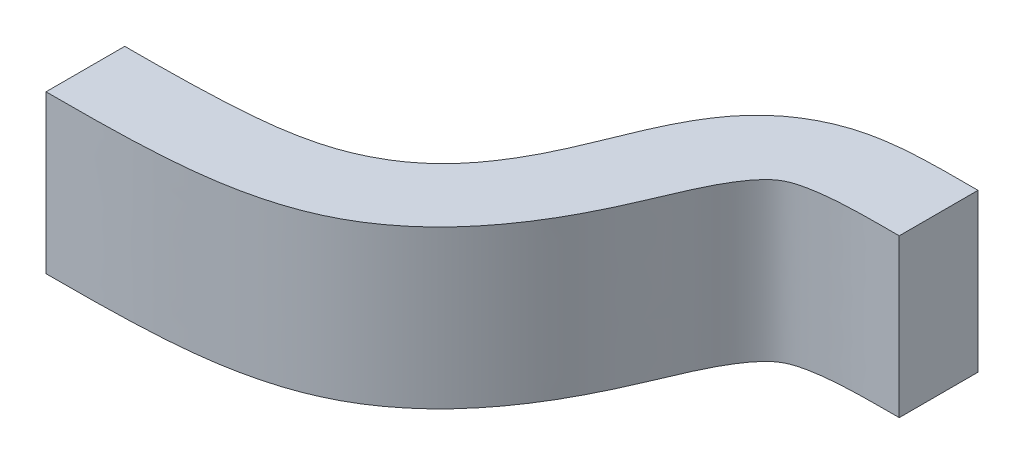
ISO-10303-21;
HEADER;
FILE_DESCRIPTION(('STEP AP214'),'2;1');
FILE_NAME('part.step','',(''),(''),'','','');
FILE_SCHEMA(('AUTOMOTIVE_DESIGN { 1 0 10303 214 1 1 1 1 }'));
ENDSEC;
DATA;
#1=APPLICATION_CONTEXT('core data for automotive mechanical design processes');
#2=APPLICATION_PROTOCOL_DEFINITION('international standard','automotive_design',2000,#1);
#3=PRODUCT_CONTEXT('',#1,'mechanical');
#4=PRODUCT('Part','Part','',(#3));
#5=PRODUCT_RELATED_PRODUCT_CATEGORY('part','',(#4));
#6=PRODUCT_DEFINITION_FORMATION('','',#4);
#7=PRODUCT_DEFINITION_CONTEXT('part definition',#1,'design');
#8=PRODUCT_DEFINITION('design','',#6,#7);
#9=PRODUCT_DEFINITION_SHAPE('','',#8);
#10=(LENGTH_UNIT() NAMED_UNIT(*) SI_UNIT(.MILLI.,.METRE.));
#11=(NAMED_UNIT(*) PLANE_ANGLE_UNIT() SI_UNIT($,.RADIAN.));
#12=(NAMED_UNIT(*) SI_UNIT($,.STERADIAN.) SOLID_ANGLE_UNIT());
#13=UNCERTAINTY_MEASURE_WITH_UNIT(LENGTH_MEASURE(1.E-05),#10,'distance_accuracy_value','');
#14=(GEOMETRIC_REPRESENTATION_CONTEXT(3) GLOBAL_UNCERTAINTY_ASSIGNED_CONTEXT((#13)) GLOBAL_UNIT_ASSIGNED_CONTEXT((#10,
#11,#12)) REPRESENTATION_CONTEXT('',''));
#15=CARTESIAN_POINT('',(0.,0.,0.));
#16=DIRECTION('',(0.,0.,1.));
#17=DIRECTION('',(1.,0.,0.));
#18=AXIS2_PLACEMENT_3D('',#15,#16,#17);
#19=CARTESIAN_POINT('',(0.,0.15,0.075));
#20=CARTESIAN_POINT('',(0.0905777344704142,0.15,0.075));
#21=CARTESIAN_POINT('',(0.285559759716426,0.15,0.0742434436378116));
#22=CARTESIAN_POINT('',(0.563518229604912,0.15,0.000968806615744211));
#23=CARTESIAN_POINT('',(0.710460925250525,0.15,-0.211613939113469));
#24=CARTESIAN_POINT('',(0.77988045420617,0.15,-0.395414769660227));
#25=CARTESIAN_POINT('',(0.827653517794069,0.15,-0.471375806830608));
#26=CARTESIAN_POINT('',(0.864080224049518,0.15,-0.490115927902738));
#27=CARTESIAN_POINT('',(0.945491982314277,0.15,-0.500044642488538));
#28=CARTESIAN_POINT('',(1.01779453444384,0.15,-0.5));
#29=CARTESIAN_POINT('',(1.05,0.15,-0.5));
#30=B_SPLINE_CURVE_WITH_KNOTS('',3,(#19,#20,#21,#22,#23,#24,#25,#26,#27,#28,#29),.UNSPECIFIED.,
.F.,.F.,(4,1,1,1,1,1,1,1,4),(0.,0.125,0.25,0.5,0.625,0.75,0.875,0.9375,1.),.UNSPECIFIED.);
#31=DIRECTION('',(0.,-1.,0.));
#32=VECTOR('',#31,1.);
#33=SURFACE_OF_LINEAR_EXTRUSION('',#30,#32);
#34=CARTESIAN_POINT('',(0.,-0.15,0.075));
#35=CARTESIAN_POINT('',(0.0905777344704142,-0.15,0.075));
#36=CARTESIAN_POINT('',(0.285559759716426,-0.15,0.0742434436378116));
#37=CARTESIAN_POINT('',(0.563518229604912,-0.15,0.000968806615744211));
#38=CARTESIAN_POINT('',(0.710460925250525,-0.15,-0.211613939113469));
#39=CARTESIAN_POINT('',(0.77988045420617,-0.15,-0.395414769660227));
#40=CARTESIAN_POINT('',(0.827653517794069,-0.15,-0.471375806830608));
#41=CARTESIAN_POINT('',(0.864080224049518,-0.15,-0.490115927902738));
#42=CARTESIAN_POINT('',(0.945491982314277,-0.15,-0.500044642488538));
#43=CARTESIAN_POINT('',(1.01779453444384,-0.15,-0.5));
#44=CARTESIAN_POINT('',(1.05,-0.15,-0.5));
#45=B_SPLINE_CURVE_WITH_KNOTS('',3,(#34,#35,#36,#37,#38,#39,#40,#41,#42,#43,#44),.UNSPECIFIED.,
.F.,.F.,(4,1,1,1,1,1,1,1,4),(0.,0.125,0.25,0.5,0.625,0.75,0.875,0.9375,1.),.UNSPECIFIED.);
#46=CARTESIAN_POINT('',(0.,-0.15,0.075));
#47=VERTEX_POINT('',#46);
#48=CARTESIAN_POINT('',(1.05,-0.15,-0.5));
#49=VERTEX_POINT('',#48);
#50=EDGE_CURVE('E127',#47,#49,#45,.T.);
#51=ORIENTED_EDGE('',*,*,#50,.T.);
#52=DIRECTION('',(0.,-1.,0.));
#53=VECTOR('',#52,1.);
#54=CARTESIAN_POINT('',(1.05,0.15,-0.5));
#55=LINE('',#54,#53);
#56=CARTESIAN_POINT('',(1.05,0.15,-0.5));
#57=VERTEX_POINT('',#56);
#58=EDGE_CURVE('E11',#57,#49,#55,.T.);
#59=ORIENTED_EDGE('',*,*,#58,.F.);
#60=CARTESIAN_POINT('',(0.,0.15,0.075));
#61=VERTEX_POINT('',#60);
#62=EDGE_CURVE('E92',#61,#57,#30,.T.);
#63=ORIENTED_EDGE('',*,*,#62,.F.);
#64=DIRECTION('',(0.,-1.,0.));
#65=VECTOR('',#64,1.);
#66=CARTESIAN_POINT('',(0.,0.15,0.075));
#67=LINE('',#66,#65);
#68=EDGE_CURVE('E104',#61,#47,#67,.T.);
#69=ORIENTED_EDGE('',*,*,#68,.T.);
#70=EDGE_LOOP('',(#51,#59,#63,#69));
#71=FACE_BOUND('',#70,.T.);
#72=ADVANCED_FACE('F39',(#71),#33,.F.);
#73=CARTESIAN_POINT('',(1.05,0.15,-0.5));
#74=DIRECTION('',(-1.,0.,0.));
#75=DIRECTION('',(0.,0.,1.));
#76=AXIS2_PLACEMENT_3D('',#73,#74,#75);
#77=PLANE('',#76);
#78=DIRECTION('',(0.,0.,-1.));
#79=VECTOR('',#78,1.);
#80=CARTESIAN_POINT('',(1.05,-0.15,-0.5));
#81=LINE('',#80,#79);
#82=CARTESIAN_POINT('',(1.05,-0.15,-0.65));
#83=VERTEX_POINT('',#82);
#84=EDGE_CURVE('E97',#49,#83,#81,.T.);
#85=ORIENTED_EDGE('',*,*,#84,.T.);
#86=DIRECTION('',(0.,-1.,0.));
#87=VECTOR('',#86,1.);
#88=CARTESIAN_POINT('',(1.05,0.15,-0.65));
#89=LINE('',#88,#87);
#90=CARTESIAN_POINT('',(1.05,0.15,-0.65));
#91=VERTEX_POINT('',#90);
#92=EDGE_CURVE('E49',#91,#83,#89,.T.);
#93=ORIENTED_EDGE('',*,*,#92,.F.);
#94=DIRECTION('',(0.,0.,-1.));
#95=VECTOR('',#94,1.);
#96=CARTESIAN_POINT('',(1.05,0.15,-0.5));
#97=LINE('',#96,#95);
#98=EDGE_CURVE('E87',#57,#91,#97,.T.);
#99=ORIENTED_EDGE('',*,*,#98,.F.);
#100=ORIENTED_EDGE('',*,*,#58,.T.);
#101=EDGE_LOOP('',(#85,#93,#99,#100));
#102=FACE_BOUND('',#101,.T.);
#103=ADVANCED_FACE('F96',(#102),#77,.F.);
#104=CARTESIAN_POINT('',(1.05,0.15,-0.65));
#105=CARTESIAN_POINT('',(0.986527120544783,0.15,-0.65));
#106=CARTESIAN_POINT('',(0.848495912860383,0.15,-0.652831583394574));
#107=CARTESIAN_POINT('',(0.663495384344212,0.15,-0.550752154752397));
#108=CARTESIAN_POINT('',(0.612041154891681,0.15,-0.35532905995528));
#109=CARTESIAN_POINT('',(0.521089185995513,0.15,-0.199989144935298));
#110=CARTESIAN_POINT('',(0.424925157901805,0.15,-0.120868300991151));
#111=CARTESIAN_POINT('',(0.27822389834113,0.15,-0.0768662044740932));
#112=CARTESIAN_POINT('',(0.0848247411347971,0.15,-0.075));
#113=CARTESIAN_POINT('',(0.,0.15,-0.075));
#114=B_SPLINE_CURVE_WITH_KNOTS('',3,(#104,#105,#106,#107,#108,#109,#110,#111,#112,#113),
.UNSPECIFIED.,.F.,.F.,(4,1,1,1,1,1,1,4),(0.,0.125,0.25,0.5,0.625,0.75,0.875,1.),.UNSPECIFIED.);
#115=DIRECTION('',(0.,-1.,0.));
#116=VECTOR('',#115,1.);
#117=SURFACE_OF_LINEAR_EXTRUSION('',#114,#116);
#118=CARTESIAN_POINT('',(1.05,-0.15,-0.65));
#119=CARTESIAN_POINT('',(0.986527120544783,-0.15,-0.65));
#120=CARTESIAN_POINT('',(0.848495912860383,-0.15,-0.652831583394574));
#121=CARTESIAN_POINT('',(0.663495384344212,-0.15,-0.550752154752397));
#122=CARTESIAN_POINT('',(0.612041154891681,-0.15,-0.35532905995528));
#123=CARTESIAN_POINT('',(0.521089185995513,-0.15,-0.199989144935298));
#124=CARTESIAN_POINT('',(0.424925157901805,-0.15,-0.120868300991151));
#125=CARTESIAN_POINT('',(0.27822389834113,-0.15,-0.0768662044740932));
#126=CARTESIAN_POINT('',(0.0848247411347971,-0.15,-0.075));
#127=CARTESIAN_POINT('',(0.,-0.15,-0.075));
#128=B_SPLINE_CURVE_WITH_KNOTS('',3,(#118,#119,#120,#121,#122,#123,#124,#125,#126,#127),
.UNSPECIFIED.,.F.,.F.,(4,1,1,1,1,1,1,4),(0.,0.125,0.25,0.5,0.625,0.75,0.875,1.),.UNSPECIFIED.);
#129=CARTESIAN_POINT('',(0.,-0.15,-0.075));
#130=VERTEX_POINT('',#129);
#131=EDGE_CURVE('E74',#83,#130,#128,.T.);
#132=ORIENTED_EDGE('',*,*,#131,.T.);
#133=DIRECTION('',(0.,-1.,0.));
#134=VECTOR('',#133,1.);
#135=CARTESIAN_POINT('',(0.,0.15,-0.075));
#136=LINE('',#135,#134);
#137=CARTESIAN_POINT('',(0.,0.15,-0.075));
#138=VERTEX_POINT('',#137);
#139=EDGE_CURVE('E99',#138,#130,#136,.T.);
#140=ORIENTED_EDGE('',*,*,#139,.F.);
#141=EDGE_CURVE('E90',#91,#138,#114,.T.);
#142=ORIENTED_EDGE('',*,*,#141,.F.);
#143=ORIENTED_EDGE('',*,*,#92,.T.);
#144=EDGE_LOOP('',(#132,#140,#142,#143));
#145=FACE_BOUND('',#144,.T.);
#146=ADVANCED_FACE('F100',(#145),#117,.F.);
#147=CARTESIAN_POINT('',(0.,0.15,0.075));
#148=DIRECTION('',(1.,0.,0.));
#149=DIRECTION('',(0.,0.,-1.));
#150=AXIS2_PLACEMENT_3D('',#147,#148,#149);
#151=PLANE('',#150);
#152=DIRECTION('',(0.,0.,1.));
#153=VECTOR('',#152,1.);
#154=CARTESIAN_POINT('',(0.,-0.15,0.075));
#155=LINE('',#154,#153);
#156=EDGE_CURVE('E80',#130,#47,#155,.T.);
#157=ORIENTED_EDGE('',*,*,#156,.T.);
#158=ORIENTED_EDGE('',*,*,#68,.F.);
#159=DIRECTION('',(0.,0.,1.));
#160=VECTOR('',#159,1.);
#161=CARTESIAN_POINT('',(0.,0.15,0.075));
#162=LINE('',#161,#160);
#163=EDGE_CURVE('E57',#138,#61,#162,.T.);
#164=ORIENTED_EDGE('',*,*,#163,.F.);
#165=ORIENTED_EDGE('',*,*,#139,.T.);
#166=EDGE_LOOP('',(#157,#158,#164,#165));
#167=FACE_BOUND('',#166,.T.);
#168=ADVANCED_FACE('F116',(#167),#151,.F.);
#169=CARTESIAN_POINT('',(0.721355543598606,0.15,-0.255165653818287));
#170=DIRECTION('',(0.,-1.,0.));
#171=DIRECTION('',(0.,0.,-1.));
#172=AXIS2_PLACEMENT_3D('',#169,#170,#171);
#173=PLANE('',#172);
#174=ORIENTED_EDGE('',*,*,#62,.T.);
#175=ORIENTED_EDGE('',*,*,#98,.T.);
#176=ORIENTED_EDGE('',*,*,#141,.T.);
#177=ORIENTED_EDGE('',*,*,#163,.T.);
#178=EDGE_LOOP('',(#174,#175,#176,#177));
#179=FACE_BOUND('',#178,.T.);
#180=ADVANCED_FACE('F88',(#179),#173,.F.);
#181=CARTESIAN_POINT('',(0.721355543598606,-0.15,-0.255165653818287));
#182=DIRECTION('',(0.,-1.,0.));
#183=DIRECTION('',(0.,0.,-1.));
#184=AXIS2_PLACEMENT_3D('',#181,#182,#183);
#185=PLANE('',#184);
#186=ORIENTED_EDGE('',*,*,#50,.F.);
#187=ORIENTED_EDGE('',*,*,#156,.F.);
#188=ORIENTED_EDGE('',*,*,#131,.F.);
#189=ORIENTED_EDGE('',*,*,#84,.F.);
#190=EDGE_LOOP('',(#186,#187,#188,#189));
#191=FACE_BOUND('',#190,.T.);
#192=ADVANCED_FACE('F150',(#191),#185,.T.);
#193=CLOSED_SHELL('',(#72,#103,#146,#168,#180,#192));
#194=MANIFOLD_SOLID_BREP('B2',#193);
#195=ADVANCED_BREP_SHAPE_REPRESENTATION('',(#18,#194),#14);
#196=SHAPE_DEFINITION_REPRESENTATION(#9,#195);
ENDSEC;
END-ISO-10303-21;
